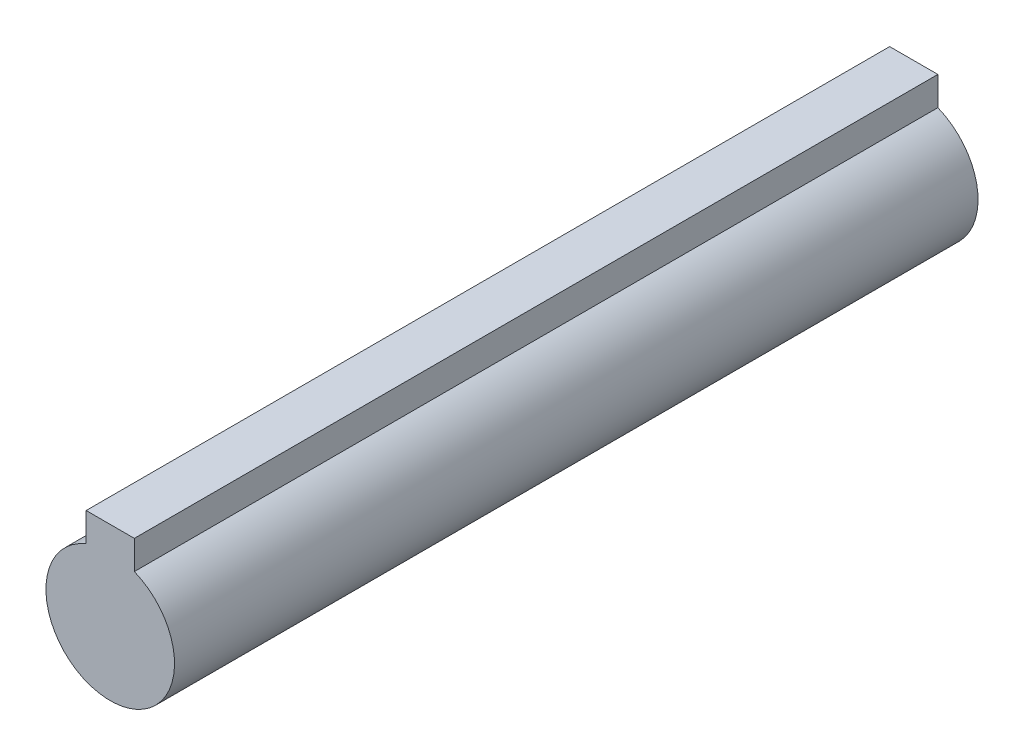
ISO-10303-21;
HEADER;
FILE_DESCRIPTION(('STEP AP214'),'2;1');
FILE_NAME('part.step','',(''),(''),'','','');
FILE_SCHEMA(('AUTOMOTIVE_DESIGN { 1 0 10303 214 1 1 1 1 }'));
ENDSEC;
DATA;
#1=APPLICATION_CONTEXT('core data for automotive mechanical design processes');
#2=APPLICATION_PROTOCOL_DEFINITION('international standard','automotive_design',2000,#1);
#3=PRODUCT_CONTEXT('',#1,'mechanical');
#4=PRODUCT('Part','Part','',(#3));
#5=PRODUCT_RELATED_PRODUCT_CATEGORY('part','',(#4));
#6=PRODUCT_DEFINITION_FORMATION('','',#4);
#7=PRODUCT_DEFINITION_CONTEXT('part definition',#1,'design');
#8=PRODUCT_DEFINITION('design','',#6,#7);
#9=PRODUCT_DEFINITION_SHAPE('','',#8);
#10=(LENGTH_UNIT() NAMED_UNIT(*) SI_UNIT(.MILLI.,.METRE.));
#11=(NAMED_UNIT(*) PLANE_ANGLE_UNIT() SI_UNIT($,.RADIAN.));
#12=(NAMED_UNIT(*) SI_UNIT($,.STERADIAN.) SOLID_ANGLE_UNIT());
#13=UNCERTAINTY_MEASURE_WITH_UNIT(LENGTH_MEASURE(1.E-05),#10,'distance_accuracy_value','');
#14=(GEOMETRIC_REPRESENTATION_CONTEXT(3) GLOBAL_UNCERTAINTY_ASSIGNED_CONTEXT((#13)) GLOBAL_UNIT_ASSIGNED_CONTEXT((#10,
#11,#12)) REPRESENTATION_CONTEXT('',''));
#15=CARTESIAN_POINT('',(0.,0.,0.));
#16=DIRECTION('',(0.,0.,1.));
#17=DIRECTION('',(1.,0.,0.));
#18=AXIS2_PLACEMENT_3D('',#15,#16,#17);
#19=CARTESIAN_POINT('',(0.,0.,25.));
#20=DIRECTION('',(0.,0.,-1.));
#21=DIRECTION('',(-1.,0.,0.));
#22=AXIS2_PLACEMENT_3D('',#19,#20,#21);
#23=CYLINDRICAL_SURFACE('',#22,4.);
#24=CARTESIAN_POINT('',(0.,0.,-25.));
#25=DIRECTION('',(0.,0.,1.));
#26=DIRECTION('',(1.,0.,0.));
#27=AXIS2_PLACEMENT_3D('',#24,#25,#26);
#28=CIRCLE('',#27,4.);
#29=CARTESIAN_POINT('',(-1.5,3.70809924354783,-25.));
#30=VERTEX_POINT('',#29);
#31=CARTESIAN_POINT('',(1.5,3.70809924354783,-25.));
#32=VERTEX_POINT('',#31);
#33=EDGE_CURVE('E112',#30,#32,#28,.T.);
#34=ORIENTED_EDGE('',*,*,#33,.T.);
#35=DIRECTION('',(0.,0.,-1.));
#36=VECTOR('',#35,1.);
#37=CARTESIAN_POINT('',(1.5,3.70809924354783,25.));
#38=LINE('',#37,#36);
#39=CARTESIAN_POINT('',(1.5,3.70809924354783,25.));
#40=VERTEX_POINT('',#39);
#41=EDGE_CURVE('E11',#40,#32,#38,.T.);
#42=ORIENTED_EDGE('',*,*,#41,.F.);
#43=CARTESIAN_POINT('',(0.,0.,25.));
#44=DIRECTION('',(0.,0.,1.));
#45=DIRECTION('',(1.,0.,0.));
#46=AXIS2_PLACEMENT_3D('',#43,#44,#45);
#47=CIRCLE('',#46,4.);
#48=CARTESIAN_POINT('',(-1.5,3.70809924354783,25.));
#49=VERTEX_POINT('',#48);
#50=EDGE_CURVE('E85',#49,#40,#47,.T.);
#51=ORIENTED_EDGE('',*,*,#50,.F.);
#52=DIRECTION('',(0.,0.,-1.));
#53=VECTOR('',#52,1.);
#54=CARTESIAN_POINT('',(-1.5,3.70809924354783,25.));
#55=LINE('',#54,#53);
#56=EDGE_CURVE('E108',#49,#30,#55,.T.);
#57=ORIENTED_EDGE('',*,*,#56,.T.);
#58=EDGE_LOOP('',(#34,#42,#51,#57));
#59=FACE_BOUND('',#58,.T.);
#60=ADVANCED_FACE('F45',(#59),#23,.T.);
#61=CARTESIAN_POINT('',(1.5,0.,25.));
#62=DIRECTION('',(1.,0.,0.));
#63=DIRECTION('',(0.,1.,0.));
#64=AXIS2_PLACEMENT_3D('',#61,#62,#63);
#65=PLANE('',#64);
#66=DIRECTION('',(0.,-1.,0.));
#67=VECTOR('',#66,1.);
#68=CARTESIAN_POINT('',(1.5,0.,-25.));
#69=LINE('',#68,#67);
#70=CARTESIAN_POINT('',(1.5,5.5,-25.));
#71=VERTEX_POINT('',#70);
#72=EDGE_CURVE('E94',#71,#32,#69,.T.);
#73=ORIENTED_EDGE('',*,*,#72,.F.);
#74=DIRECTION('',(0.,0.,-1.));
#75=VECTOR('',#74,1.);
#76=CARTESIAN_POINT('',(1.5,5.5,25.));
#77=LINE('',#76,#75);
#78=CARTESIAN_POINT('',(1.5,5.5,25.));
#79=VERTEX_POINT('',#78);
#80=EDGE_CURVE('E54',#79,#71,#77,.T.);
#81=ORIENTED_EDGE('',*,*,#80,.F.);
#82=DIRECTION('',(0.,-1.,0.));
#83=VECTOR('',#82,1.);
#84=CARTESIAN_POINT('',(1.5,0.,25.));
#85=LINE('',#84,#83);
#86=EDGE_CURVE('E92',#79,#40,#85,.T.);
#87=ORIENTED_EDGE('',*,*,#86,.T.);
#88=ORIENTED_EDGE('',*,*,#41,.T.);
#89=EDGE_LOOP('',(#73,#81,#87,#88));
#90=FACE_BOUND('',#89,.T.);
#91=ADVANCED_FACE('F91',(#90),#65,.T.);
#92=CARTESIAN_POINT('',(0.,5.5,25.));
#93=DIRECTION('',(0.,1.,0.));
#94=DIRECTION('',(0.,0.,1.));
#95=AXIS2_PLACEMENT_3D('',#92,#93,#94);
#96=PLANE('',#95);
#97=DIRECTION('',(1.,0.,0.));
#98=VECTOR('',#97,1.);
#99=CARTESIAN_POINT('',(0.,5.5,-25.));
#100=LINE('',#99,#98);
#101=CARTESIAN_POINT('',(-1.5,5.5,-25.));
#102=VERTEX_POINT('',#101);
#103=EDGE_CURVE('E118',#102,#71,#100,.T.);
#104=ORIENTED_EDGE('',*,*,#103,.F.);
#105=DIRECTION('',(0.,0.,-1.));
#106=VECTOR('',#105,1.);
#107=CARTESIAN_POINT('',(-1.5,5.5,25.));
#108=LINE('',#107,#106);
#109=CARTESIAN_POINT('',(-1.5,5.5,25.));
#110=VERTEX_POINT('',#109);
#111=EDGE_CURVE('E77',#110,#102,#108,.T.);
#112=ORIENTED_EDGE('',*,*,#111,.F.);
#113=DIRECTION('',(1.,0.,0.));
#114=VECTOR('',#113,1.);
#115=CARTESIAN_POINT('',(0.,5.5,25.));
#116=LINE('',#115,#114);
#117=EDGE_CURVE('E101',#110,#79,#116,.T.);
#118=ORIENTED_EDGE('',*,*,#117,.T.);
#119=ORIENTED_EDGE('',*,*,#80,.T.);
#120=EDGE_LOOP('',(#104,#112,#118,#119));
#121=FACE_BOUND('',#120,.T.);
#122=ADVANCED_FACE('F104',(#121),#96,.T.);
#123=CARTESIAN_POINT('',(-1.5,0.,25.));
#124=DIRECTION('',(1.,0.,0.));
#125=DIRECTION('',(0.,1.,0.));
#126=AXIS2_PLACEMENT_3D('',#123,#124,#125);
#127=PLANE('',#126);
#128=DIRECTION('',(0.,-1.,0.));
#129=VECTOR('',#128,1.);
#130=CARTESIAN_POINT('',(-1.5,0.,-25.));
#131=LINE('',#130,#129);
#132=EDGE_CURVE('E80',#102,#30,#131,.T.);
#133=ORIENTED_EDGE('',*,*,#132,.T.);
#134=ORIENTED_EDGE('',*,*,#56,.F.);
#135=DIRECTION('',(0.,-1.,0.));
#136=VECTOR('',#135,1.);
#137=CARTESIAN_POINT('',(-1.5,0.,25.));
#138=LINE('',#137,#136);
#139=EDGE_CURVE('E62',#110,#49,#138,.T.);
#140=ORIENTED_EDGE('',*,*,#139,.F.);
#141=ORIENTED_EDGE('',*,*,#111,.T.);
#142=EDGE_LOOP('',(#133,#134,#140,#141));
#143=FACE_BOUND('',#142,.T.);
#144=ADVANCED_FACE('F135',(#143),#127,.F.);
#145=CARTESIAN_POINT('',(0.,0.,25.));
#146=DIRECTION('',(0.,0.,1.));
#147=DIRECTION('',(1.,0.,0.));
#148=AXIS2_PLACEMENT_3D('',#145,#146,#147);
#149=PLANE('',#148);
#150=ORIENTED_EDGE('',*,*,#50,.T.);
#151=ORIENTED_EDGE('',*,*,#86,.F.);
#152=ORIENTED_EDGE('',*,*,#117,.F.);
#153=ORIENTED_EDGE('',*,*,#139,.T.);
#154=EDGE_LOOP('',(#150,#151,#152,#153));
#155=FACE_BOUND('',#154,.T.);
#156=ADVANCED_FACE('F100',(#155),#149,.T.);
#157=CARTESIAN_POINT('',(0.,0.,-25.));
#158=DIRECTION('',(0.,0.,1.));
#159=DIRECTION('',(1.,0.,0.));
#160=AXIS2_PLACEMENT_3D('',#157,#158,#159);
#161=PLANE('',#160);
#162=ORIENTED_EDGE('',*,*,#33,.F.);
#163=ORIENTED_EDGE('',*,*,#132,.F.);
#164=ORIENTED_EDGE('',*,*,#103,.T.);
#165=ORIENTED_EDGE('',*,*,#72,.T.);
#166=EDGE_LOOP('',(#162,#163,#164,#165));
#167=FACE_BOUND('',#166,.T.);
#168=ADVANCED_FACE('F129',(#167),#161,.F.);
#169=CLOSED_SHELL('',(#60,#91,#122,#144,#156,#168));
#170=MANIFOLD_SOLID_BREP('B2',#169);
#171=ADVANCED_BREP_SHAPE_REPRESENTATION('',(#18,#170),#14);
#172=SHAPE_DEFINITION_REPRESENTATION(#9,#171);
ENDSEC;
END-ISO-10303-21;
